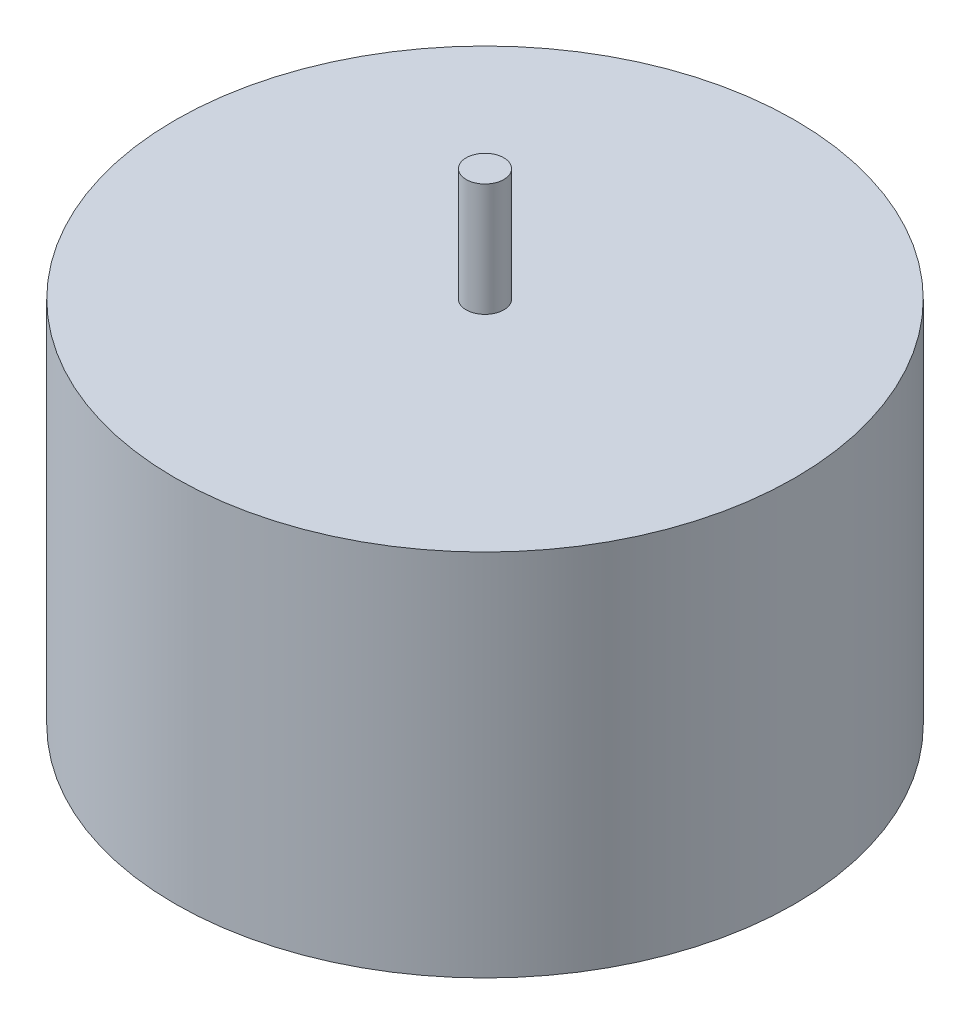
ISO-10303-21;
HEADER;
FILE_DESCRIPTION(('STEP AP214'),'2;1');
FILE_NAME('part.step','',(''),(''),'','','');
FILE_SCHEMA(('AUTOMOTIVE_DESIGN { 1 0 10303 214 1 1 1 1 }'));
ENDSEC;
DATA;
#1=APPLICATION_CONTEXT('core data for automotive mechanical design processes');
#2=APPLICATION_PROTOCOL_DEFINITION('international standard','automotive_design',2000,#1);
#3=PRODUCT_CONTEXT('',#1,'mechanical');
#4=PRODUCT('Part','Part','',(#3));
#5=PRODUCT_RELATED_PRODUCT_CATEGORY('part','',(#4));
#6=PRODUCT_DEFINITION_FORMATION('','',#4);
#7=PRODUCT_DEFINITION_CONTEXT('part definition',#1,'design');
#8=PRODUCT_DEFINITION('design','',#6,#7);
#9=PRODUCT_DEFINITION_SHAPE('','',#8);
#10=(LENGTH_UNIT() NAMED_UNIT(*) SI_UNIT(.MILLI.,.METRE.));
#11=(NAMED_UNIT(*) PLANE_ANGLE_UNIT() SI_UNIT($,.RADIAN.));
#12=(NAMED_UNIT(*) SI_UNIT($,.STERADIAN.) SOLID_ANGLE_UNIT());
#13=UNCERTAINTY_MEASURE_WITH_UNIT(LENGTH_MEASURE(1.E-05),#10,'distance_accuracy_value','');
#14=(GEOMETRIC_REPRESENTATION_CONTEXT(3) GLOBAL_UNCERTAINTY_ASSIGNED_CONTEXT((#13)) GLOBAL_UNIT_ASSIGNED_CONTEXT((#10,
#11,#12)) REPRESENTATION_CONTEXT('',''));
#15=CARTESIAN_POINT('',(0.,0.,0.));
#16=DIRECTION('',(0.,0.,1.));
#17=DIRECTION('',(1.,0.,0.));
#18=AXIS2_PLACEMENT_3D('',#15,#16,#17);
#19=CARTESIAN_POINT('',(-33.3919806594465,14.7,-17.6638738270985));
#20=DIRECTION('',(0.,-1.,0.));
#21=DIRECTION('',(0.,0.,-1.));
#22=AXIS2_PLACEMENT_3D('',#19,#20,#21);
#23=CYLINDRICAL_SURFACE('',#22,12.35);
#24=CARTESIAN_POINT('',(-33.3919806594465,14.7,-17.6638738270985));
#25=DIRECTION('',(0.,1.,0.));
#26=DIRECTION('',(0.,0.,1.));
#27=AXIS2_PLACEMENT_3D('',#24,#25,#26);
#28=CIRCLE('',#27,12.35);
#29=CARTESIAN_POINT('',(-33.3919806594465,14.7,-5.31387382709848));
#30=VERTEX_POINT('',#29);
#31=EDGE_CURVE('E10',#30,#30,#28,.T.);
#32=ORIENTED_EDGE('',*,*,#31,.F.);
#33=EDGE_LOOP('',(#32));
#34=FACE_BOUND('',#33,.T.);
#35=CARTESIAN_POINT('',(-33.3919806594465,0.,-17.6638738270985));
#36=DIRECTION('',(0.,1.,0.));
#37=DIRECTION('',(0.,0.,1.));
#38=AXIS2_PLACEMENT_3D('',#35,#36,#37);
#39=CIRCLE('',#38,12.35);
#40=CARTESIAN_POINT('',(-33.3919806594465,0.,-5.31387382709848));
#41=VERTEX_POINT('',#40);
#42=EDGE_CURVE('E46',#41,#41,#39,.T.);
#43=ORIENTED_EDGE('',*,*,#42,.T.);
#44=EDGE_LOOP('',(#43));
#45=FACE_BOUND('',#44,.T.);
#46=ADVANCED_FACE('F43',(#34,#45),#23,.T.);
#47=CARTESIAN_POINT('',(-33.3919806594465,14.7,-17.6638738270985));
#48=DIRECTION('',(0.,1.,0.));
#49=DIRECTION('',(0.,0.,1.));
#50=AXIS2_PLACEMENT_3D('',#47,#48,#49);
#51=PLANE('',#50);
#52=CARTESIAN_POINT('',(-33.3919806594465,14.7,-17.6638738270985));
#53=DIRECTION('',(0.,1.,0.));
#54=DIRECTION('',(0.,0.,1.));
#55=AXIS2_PLACEMENT_3D('',#52,#53,#54);
#56=CIRCLE('',#55,0.749999999999999);
#57=CARTESIAN_POINT('',(-33.3919806594465,14.7,-16.9138738270985));
#58=VERTEX_POINT('',#57);
#59=EDGE_CURVE('E57',#58,#58,#56,.T.);
#60=ORIENTED_EDGE('',*,*,#59,.F.);
#61=EDGE_LOOP('',(#60));
#62=FACE_BOUND('',#61,.T.);
#63=ORIENTED_EDGE('',*,*,#31,.T.);
#64=EDGE_LOOP('',(#63));
#65=FACE_BOUND('',#64,.T.);
#66=ADVANCED_FACE('F74',(#62,#65),#51,.T.);
#67=CARTESIAN_POINT('',(-33.3919806594465,0.,-17.6638738270985));
#68=DIRECTION('',(0.,1.,0.));
#69=DIRECTION('',(0.,0.,1.));
#70=AXIS2_PLACEMENT_3D('',#67,#68,#69);
#71=PLANE('',#70);
#72=ORIENTED_EDGE('',*,*,#42,.F.);
#73=EDGE_LOOP('',(#72));
#74=FACE_BOUND('',#73,.T.);
#75=ADVANCED_FACE('F70',(#74),#71,.F.);
#76=CARTESIAN_POINT('',(-33.3919806594465,19.2,-17.6638738270985));
#77=DIRECTION('',(0.,-1.,0.));
#78=DIRECTION('',(0.,0.,-1.));
#79=AXIS2_PLACEMENT_3D('',#76,#77,#78);
#80=CYLINDRICAL_SURFACE('',#79,0.749999999999999);
#81=CARTESIAN_POINT('',(-33.3919806594465,19.2,-17.6638738270985));
#82=DIRECTION('',(0.,1.,0.));
#83=DIRECTION('',(0.,0.,1.));
#84=AXIS2_PLACEMENT_3D('',#81,#82,#83);
#85=CIRCLE('',#84,0.749999999999999);
#86=CARTESIAN_POINT('',(-33.3919806594465,19.2,-16.9138738270985));
#87=VERTEX_POINT('',#86);
#88=EDGE_CURVE('E55',#87,#87,#85,.T.);
#89=ORIENTED_EDGE('',*,*,#88,.F.);
#90=EDGE_LOOP('',(#89));
#91=FACE_BOUND('',#90,.T.);
#92=ORIENTED_EDGE('',*,*,#59,.T.);
#93=EDGE_LOOP('',(#92));
#94=FACE_BOUND('',#93,.T.);
#95=ADVANCED_FACE('F67',(#91,#94),#80,.T.);
#96=CARTESIAN_POINT('',(-33.3919806594465,19.2,-17.6638738270985));
#97=DIRECTION('',(0.,1.,0.));
#98=DIRECTION('',(0.,0.,1.));
#99=AXIS2_PLACEMENT_3D('',#96,#97,#98);
#100=PLANE('',#99);
#101=ORIENTED_EDGE('',*,*,#88,.T.);
#102=EDGE_LOOP('',(#101));
#103=FACE_BOUND('',#102,.T.);
#104=ADVANCED_FACE('F65',(#103),#100,.T.);
#105=CLOSED_SHELL('',(#46,#66,#75,#95,#104));
#106=MANIFOLD_SOLID_BREP('B2',#105);
#107=ADVANCED_BREP_SHAPE_REPRESENTATION('',(#18,#106),#14);
#108=SHAPE_DEFINITION_REPRESENTATION(#9,#107);
ENDSEC;
END-ISO-10303-21;
